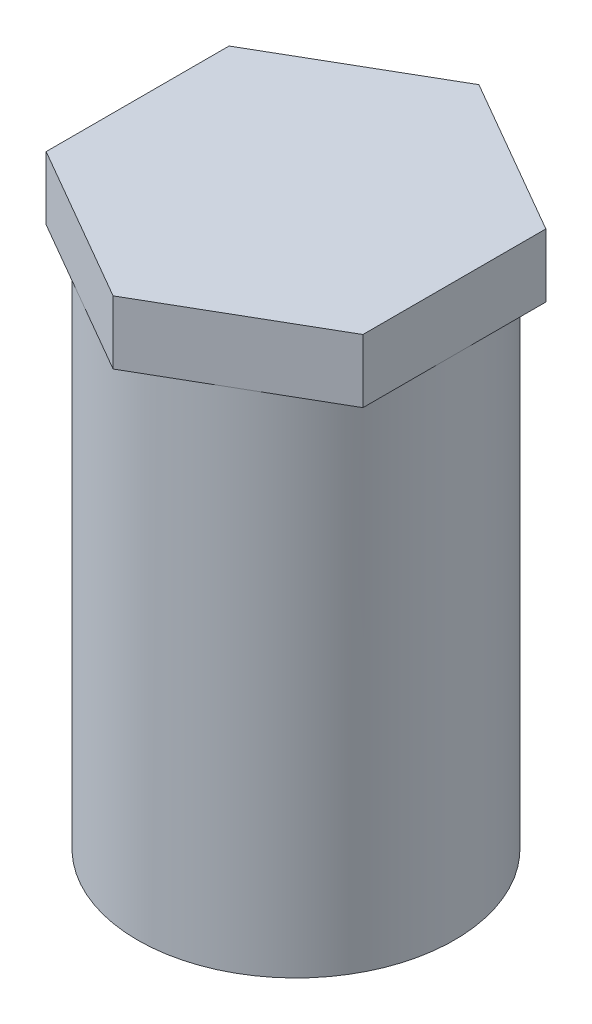
ISO-10303-21;
HEADER;
FILE_DESCRIPTION(('STEP AP214'),'2;1');
FILE_NAME('part.step','',(''),(''),'','','');
FILE_SCHEMA(('AUTOMOTIVE_DESIGN { 1 0 10303 214 1 1 1 1 }'));
ENDSEC;
DATA;
#1=APPLICATION_CONTEXT('core data for automotive mechanical design processes');
#2=APPLICATION_PROTOCOL_DEFINITION('international standard','automotive_design',2000,#1);
#3=PRODUCT_CONTEXT('',#1,'mechanical');
#4=PRODUCT('Part','Part','',(#3));
#5=PRODUCT_RELATED_PRODUCT_CATEGORY('part','',(#4));
#6=PRODUCT_DEFINITION_FORMATION('','',#4);
#7=PRODUCT_DEFINITION_CONTEXT('part definition',#1,'design');
#8=PRODUCT_DEFINITION('design','',#6,#7);
#9=PRODUCT_DEFINITION_SHAPE('','',#8);
#10=(LENGTH_UNIT() NAMED_UNIT(*) SI_UNIT(.MILLI.,.METRE.));
#11=(NAMED_UNIT(*) PLANE_ANGLE_UNIT() SI_UNIT($,.RADIAN.));
#12=(NAMED_UNIT(*) SI_UNIT($,.STERADIAN.) SOLID_ANGLE_UNIT());
#13=UNCERTAINTY_MEASURE_WITH_UNIT(LENGTH_MEASURE(1.E-05),#10,'distance_accuracy_value','');
#14=(GEOMETRIC_REPRESENTATION_CONTEXT(3) GLOBAL_UNCERTAINTY_ASSIGNED_CONTEXT((#13)) GLOBAL_UNIT_ASSIGNED_CONTEXT((#10,
#11,#12)) REPRESENTATION_CONTEXT('',''));
#15=CARTESIAN_POINT('',(0.,0.,0.));
#16=DIRECTION('',(0.,0.,1.));
#17=DIRECTION('',(1.,0.,0.));
#18=AXIS2_PLACEMENT_3D('',#15,#16,#17);
#19=CARTESIAN_POINT('',(0.,40.,0.));
#20=DIRECTION('',(0.,-1.,0.));
#21=DIRECTION('',(0.,0.,-1.));
#22=AXIS2_PLACEMENT_3D('',#19,#20,#21);
#23=CYLINDRICAL_SURFACE('',#22,12.5);
#24=CARTESIAN_POINT('',(0.,40.,0.));
#25=DIRECTION('',(0.,1.,0.));
#26=DIRECTION('',(0.,0.,1.));
#27=AXIS2_PLACEMENT_3D('',#24,#25,#26);
#28=CIRCLE('',#27,12.5);
#29=CARTESIAN_POINT('',(6.25,40.,10.8253175473055));
#30=VERTEX_POINT('',#29);
#31=CARTESIAN_POINT('',(12.5,40.,0.));
#32=VERTEX_POINT('',#31);
#33=EDGE_CURVE('E11',#30,#32,#28,.T.);
#34=ORIENTED_EDGE('',*,*,#33,.F.);
#35=CARTESIAN_POINT('',(-6.25000000000001,40.,10.8253175473055));
#36=VERTEX_POINT('',#35);
#37=EDGE_CURVE('E43',#36,#30,#28,.T.);
#38=ORIENTED_EDGE('',*,*,#37,.F.);
#39=CARTESIAN_POINT('',(-12.5,40.,0.));
#40=VERTEX_POINT('',#39);
#41=EDGE_CURVE('E53',#40,#36,#28,.T.);
#42=ORIENTED_EDGE('',*,*,#41,.F.);
#43=CARTESIAN_POINT('',(-6.25000000000001,40.,-10.8253175473055));
#44=VERTEX_POINT('',#43);
#45=EDGE_CURVE('E193',#44,#40,#28,.T.);
#46=ORIENTED_EDGE('',*,*,#45,.F.);
#47=CARTESIAN_POINT('',(6.25,40.,-10.8253175473055));
#48=VERTEX_POINT('',#47);
#49=EDGE_CURVE('E203',#48,#44,#28,.T.);
#50=ORIENTED_EDGE('',*,*,#49,.F.);
#51=EDGE_CURVE('E42',#32,#48,#28,.T.);
#52=ORIENTED_EDGE('',*,*,#51,.F.);
#53=EDGE_LOOP('',(#34,#38,#42,#46,#50,#52));
#54=FACE_BOUND('',#53,.T.);
#55=CARTESIAN_POINT('',(0.,0.,0.));
#56=DIRECTION('',(0.,1.,0.));
#57=DIRECTION('',(0.,0.,1.));
#58=AXIS2_PLACEMENT_3D('',#55,#56,#57);
#59=CIRCLE('',#58,12.5);
#60=CARTESIAN_POINT('',(0.,0.,12.5));
#61=VERTEX_POINT('',#60);
#62=EDGE_CURVE('E37',#61,#61,#59,.T.);
#63=ORIENTED_EDGE('',*,*,#62,.T.);
#64=EDGE_LOOP('',(#63));
#65=FACE_BOUND('',#64,.T.);
#66=ADVANCED_FACE('F34',(#54,#65),#23,.T.);
#67=CARTESIAN_POINT('',(0.,0.,0.));
#68=DIRECTION('',(0.,1.,0.));
#69=DIRECTION('',(0.,0.,1.));
#70=AXIS2_PLACEMENT_3D('',#67,#68,#69);
#71=PLANE('',#70);
#72=ORIENTED_EDGE('',*,*,#62,.F.);
#73=EDGE_LOOP('',(#72));
#74=FACE_BOUND('',#73,.T.);
#75=ADVANCED_FACE('F211',(#74),#71,.F.);
#76=CARTESIAN_POINT('',(0.,40.,0.));
#77=DIRECTION('',(0.,1.,0.));
#78=DIRECTION('',(0.,0.,1.));
#79=AXIS2_PLACEMENT_3D('',#76,#77,#78);
#80=PLANE('',#79);
#81=DIRECTION('',(0.866025403784438,0.,-0.5));
#82=VECTOR('',#81,1.);
#83=CARTESIAN_POINT('',(0.,40.,14.4337567297406));
#84=LINE('',#83,#82);
#85=CARTESIAN_POINT('',(12.5,40.,7.21687836487032));
#86=VERTEX_POINT('',#85);
#87=EDGE_CURVE('E162',#30,#86,#84,.T.);
#88=ORIENTED_EDGE('',*,*,#87,.F.);
#89=ORIENTED_EDGE('',*,*,#33,.T.);
#90=DIRECTION('',(0.,0.,-1.));
#91=VECTOR('',#90,1.);
#92=CARTESIAN_POINT('',(12.5,40.,7.21687836487032));
#93=LINE('',#92,#91);
#94=EDGE_CURVE('E156',#86,#32,#93,.T.);
#95=ORIENTED_EDGE('',*,*,#94,.F.);
#96=EDGE_LOOP('',(#88,#89,#95));
#97=FACE_BOUND('',#96,.T.);
#98=ADVANCED_FACE('F199',(#97),#80,.F.);
#99=CARTESIAN_POINT('',(12.5,40.,-7.21687836487033));
#100=VERTEX_POINT('',#99);
#101=EDGE_CURVE('E159',#32,#100,#93,.T.);
#102=ORIENTED_EDGE('',*,*,#101,.F.);
#103=ORIENTED_EDGE('',*,*,#51,.T.);
#104=DIRECTION('',(-0.866025403784439,0.,-0.5));
#105=VECTOR('',#104,1.);
#106=CARTESIAN_POINT('',(12.5,40.,-7.21687836487033));
#107=LINE('',#106,#105);
#108=EDGE_CURVE('E152',#100,#48,#107,.T.);
#109=ORIENTED_EDGE('',*,*,#108,.F.);
#110=EDGE_LOOP('',(#102,#103,#109));
#111=FACE_BOUND('',#110,.T.);
#112=ADVANCED_FACE('F202',(#111),#80,.F.);
#113=CARTESIAN_POINT('',(0.,40.,-14.4337567297407));
#114=VERTEX_POINT('',#113);
#115=EDGE_CURVE('E155',#48,#114,#107,.T.);
#116=ORIENTED_EDGE('',*,*,#115,.F.);
#117=ORIENTED_EDGE('',*,*,#49,.T.);
#118=DIRECTION('',(-0.866025403784439,0.,0.5));
#119=VECTOR('',#118,1.);
#120=CARTESIAN_POINT('',(0.,40.,-14.4337567297407));
#121=LINE('',#120,#119);
#122=EDGE_CURVE('E148',#114,#44,#121,.T.);
#123=ORIENTED_EDGE('',*,*,#122,.F.);
#124=EDGE_LOOP('',(#116,#117,#123));
#125=FACE_BOUND('',#124,.T.);
#126=ADVANCED_FACE('F206',(#125),#80,.F.);
#127=CARTESIAN_POINT('',(-12.5,40.,-7.21687836487032));
#128=VERTEX_POINT('',#127);
#129=EDGE_CURVE('E151',#44,#128,#121,.T.);
#130=ORIENTED_EDGE('',*,*,#129,.F.);
#131=ORIENTED_EDGE('',*,*,#45,.T.);
#132=DIRECTION('',(0.,0.,1.));
#133=VECTOR('',#132,1.);
#134=CARTESIAN_POINT('',(-12.5,40.,-7.21687836487032));
#135=LINE('',#134,#133);
#136=EDGE_CURVE('E123',#128,#40,#135,.T.);
#137=ORIENTED_EDGE('',*,*,#136,.F.);
#138=EDGE_LOOP('',(#130,#131,#137));
#139=FACE_BOUND('',#138,.T.);
#140=ADVANCED_FACE('F208',(#139),#80,.F.);
#141=CARTESIAN_POINT('',(-12.5,40.,7.21687836487032));
#142=VERTEX_POINT('',#141);
#143=EDGE_CURVE('E147',#40,#142,#135,.T.);
#144=ORIENTED_EDGE('',*,*,#143,.F.);
#145=ORIENTED_EDGE('',*,*,#41,.T.);
#146=DIRECTION('',(0.866025403784439,0.,0.5));
#147=VECTOR('',#146,1.);
#148=CARTESIAN_POINT('',(-12.5,40.,7.21687836487032));
#149=LINE('',#148,#147);
#150=EDGE_CURVE('E163',#142,#36,#149,.T.);
#151=ORIENTED_EDGE('',*,*,#150,.F.);
#152=EDGE_LOOP('',(#144,#145,#151));
#153=FACE_BOUND('',#152,.T.);
#154=ADVANCED_FACE('F192',(#153),#80,.F.);
#155=CARTESIAN_POINT('',(0.,40.,14.4337567297406));
#156=VERTEX_POINT('',#155);
#157=EDGE_CURVE('E128',#36,#156,#149,.T.);
#158=ORIENTED_EDGE('',*,*,#157,.F.);
#159=ORIENTED_EDGE('',*,*,#37,.T.);
#160=EDGE_CURVE('E160',#156,#30,#84,.T.);
#161=ORIENTED_EDGE('',*,*,#160,.F.);
#162=EDGE_LOOP('',(#158,#159,#161));
#163=FACE_BOUND('',#162,.T.);
#164=ADVANCED_FACE('F195',(#163),#80,.F.);
#165=CARTESIAN_POINT('',(-12.5,45.,7.21687836487032));
#166=DIRECTION('',(0.5,0.,-0.866025403784439));
#167=DIRECTION('',(-0.866025403784439,0.,-0.5));
#168=AXIS2_PLACEMENT_3D('',#165,#166,#167);
#169=PLANE('',#168);
#170=ORIENTED_EDGE('',*,*,#150,.T.);
#171=ORIENTED_EDGE('',*,*,#157,.T.);
#172=DIRECTION('',(0.,-1.,0.));
#173=VECTOR('',#172,1.);
#174=CARTESIAN_POINT('',(0.,45.,14.4337567297406));
#175=LINE('',#174,#173);
#176=CARTESIAN_POINT('',(0.,45.,14.4337567297406));
#177=VERTEX_POINT('',#176);
#178=EDGE_CURVE('E108',#177,#156,#175,.T.);
#179=ORIENTED_EDGE('',*,*,#178,.F.);
#180=DIRECTION('',(0.866025403784439,0.,0.5));
#181=VECTOR('',#180,1.);
#182=CARTESIAN_POINT('',(-12.5,45.,7.21687836487032));
#183=LINE('',#182,#181);
#184=CARTESIAN_POINT('',(-12.5,45.,7.21687836487032));
#185=VERTEX_POINT('',#184);
#186=EDGE_CURVE('E114',#185,#177,#183,.T.);
#187=ORIENTED_EDGE('',*,*,#186,.F.);
#188=DIRECTION('',(0.,-1.,0.));
#189=VECTOR('',#188,1.);
#190=CARTESIAN_POINT('',(-12.5,45.,7.21687836487032));
#191=LINE('',#190,#189);
#192=EDGE_CURVE('E143',#185,#142,#191,.T.);
#193=ORIENTED_EDGE('',*,*,#192,.T.);
#194=EDGE_LOOP('',(#170,#171,#179,#187,#193));
#195=FACE_BOUND('',#194,.T.);
#196=ADVANCED_FACE('F126',(#195),#169,.F.);
#197=CARTESIAN_POINT('',(0.,45.,14.4337567297406));
#198=DIRECTION('',(-0.5,0.,-0.866025403784439));
#199=DIRECTION('',(-0.866025403784439,0.,0.5));
#200=AXIS2_PLACEMENT_3D('',#197,#198,#199);
#201=PLANE('',#200);
#202=ORIENTED_EDGE('',*,*,#160,.T.);
#203=ORIENTED_EDGE('',*,*,#87,.T.);
#204=DIRECTION('',(0.,-1.,0.));
#205=VECTOR('',#204,1.);
#206=CARTESIAN_POINT('',(12.5,45.,7.21687836487032));
#207=LINE('',#206,#205);
#208=CARTESIAN_POINT('',(12.5,45.,7.21687836487032));
#209=VERTEX_POINT('',#208);
#210=EDGE_CURVE('E110',#209,#86,#207,.T.);
#211=ORIENTED_EDGE('',*,*,#210,.F.);
#212=DIRECTION('',(0.866025403784438,0.,-0.5));
#213=VECTOR('',#212,1.);
#214=CARTESIAN_POINT('',(0.,45.,14.4337567297406));
#215=LINE('',#214,#213);
#216=EDGE_CURVE('E103',#177,#209,#215,.T.);
#217=ORIENTED_EDGE('',*,*,#216,.F.);
#218=ORIENTED_EDGE('',*,*,#178,.T.);
#219=EDGE_LOOP('',(#202,#203,#211,#217,#218));
#220=FACE_BOUND('',#219,.T.);
#221=ADVANCED_FACE('F106',(#220),#201,.F.);
#222=CARTESIAN_POINT('',(12.5,45.,7.21687836487032));
#223=DIRECTION('',(-1.,0.,0.));
#224=DIRECTION('',(0.,0.,1.));
#225=AXIS2_PLACEMENT_3D('',#222,#223,#224);
#226=PLANE('',#225);
#227=ORIENTED_EDGE('',*,*,#94,.T.);
#228=ORIENTED_EDGE('',*,*,#101,.T.);
#229=DIRECTION('',(0.,-1.,0.));
#230=VECTOR('',#229,1.);
#231=CARTESIAN_POINT('',(12.5,45.,-7.21687836487033));
#232=LINE('',#231,#230);
#233=CARTESIAN_POINT('',(12.5,45.,-7.21687836487033));
#234=VERTEX_POINT('',#233);
#235=EDGE_CURVE('E132',#234,#100,#232,.T.);
#236=ORIENTED_EDGE('',*,*,#235,.F.);
#237=DIRECTION('',(0.,0.,-1.));
#238=VECTOR('',#237,1.);
#239=CARTESIAN_POINT('',(12.5,45.,7.21687836487032));
#240=LINE('',#239,#238);
#241=EDGE_CURVE('E113',#209,#234,#240,.T.);
#242=ORIENTED_EDGE('',*,*,#241,.F.);
#243=ORIENTED_EDGE('',*,*,#210,.T.);
#244=EDGE_LOOP('',(#227,#228,#236,#242,#243));
#245=FACE_BOUND('',#244,.T.);
#246=ADVANCED_FACE('F174',(#245),#226,.F.);
#247=CARTESIAN_POINT('',(12.5,45.,-7.21687836487033));
#248=DIRECTION('',(-0.5,0.,0.866025403784439));
#249=DIRECTION('',(0.866025403784439,0.,0.5));
#250=AXIS2_PLACEMENT_3D('',#247,#248,#249);
#251=PLANE('',#250);
#252=ORIENTED_EDGE('',*,*,#108,.T.);
#253=ORIENTED_EDGE('',*,*,#115,.T.);
#254=DIRECTION('',(0.,-1.,0.));
#255=VECTOR('',#254,1.);
#256=CARTESIAN_POINT('',(0.,45.,-14.4337567297407));
#257=LINE('',#256,#255);
#258=CARTESIAN_POINT('',(0.,45.,-14.4337567297407));
#259=VERTEX_POINT('',#258);
#260=EDGE_CURVE('E137',#259,#114,#257,.T.);
#261=ORIENTED_EDGE('',*,*,#260,.F.);
#262=DIRECTION('',(-0.866025403784439,0.,-0.5));
#263=VECTOR('',#262,1.);
#264=CARTESIAN_POINT('',(12.5,45.,-7.21687836487033));
#265=LINE('',#264,#263);
#266=EDGE_CURVE('E168',#234,#259,#265,.T.);
#267=ORIENTED_EDGE('',*,*,#266,.F.);
#268=ORIENTED_EDGE('',*,*,#235,.T.);
#269=EDGE_LOOP('',(#252,#253,#261,#267,#268));
#270=FACE_BOUND('',#269,.T.);
#271=ADVANCED_FACE('F178',(#270),#251,.F.);
#272=CARTESIAN_POINT('',(0.,45.,-14.4337567297407));
#273=DIRECTION('',(0.5,0.,0.866025403784439));
#274=DIRECTION('',(0.866025403784439,0.,-0.5));
#275=AXIS2_PLACEMENT_3D('',#272,#273,#274);
#276=PLANE('',#275);
#277=ORIENTED_EDGE('',*,*,#122,.T.);
#278=ORIENTED_EDGE('',*,*,#129,.T.);
#279=DIRECTION('',(0.,-1.,0.));
#280=VECTOR('',#279,1.);
#281=CARTESIAN_POINT('',(-12.5,45.,-7.21687836487032));
#282=LINE('',#281,#280);
#283=CARTESIAN_POINT('',(-12.5,45.,-7.21687836487032));
#284=VERTEX_POINT('',#283);
#285=EDGE_CURVE('E140',#284,#128,#282,.T.);
#286=ORIENTED_EDGE('',*,*,#285,.F.);
#287=DIRECTION('',(-0.866025403784439,0.,0.5));
#288=VECTOR('',#287,1.);
#289=CARTESIAN_POINT('',(0.,45.,-14.4337567297407));
#290=LINE('',#289,#288);
#291=EDGE_CURVE('E166',#259,#284,#290,.T.);
#292=ORIENTED_EDGE('',*,*,#291,.F.);
#293=ORIENTED_EDGE('',*,*,#260,.T.);
#294=EDGE_LOOP('',(#277,#278,#286,#292,#293));
#295=FACE_BOUND('',#294,.T.);
#296=ADVANCED_FACE('F184',(#295),#276,.F.);
#297=CARTESIAN_POINT('',(-12.5,45.,-7.21687836487032));
#298=DIRECTION('',(1.,0.,0.));
#299=DIRECTION('',(0.,0.,-1.));
#300=AXIS2_PLACEMENT_3D('',#297,#298,#299);
#301=PLANE('',#300);
#302=ORIENTED_EDGE('',*,*,#136,.T.);
#303=ORIENTED_EDGE('',*,*,#143,.T.);
#304=ORIENTED_EDGE('',*,*,#192,.F.);
#305=DIRECTION('',(0.,0.,1.));
#306=VECTOR('',#305,1.);
#307=CARTESIAN_POINT('',(-12.5,45.,-7.21687836487032));
#308=LINE('',#307,#306);
#309=EDGE_CURVE('E119',#284,#185,#308,.T.);
#310=ORIENTED_EDGE('',*,*,#309,.F.);
#311=ORIENTED_EDGE('',*,*,#285,.T.);
#312=EDGE_LOOP('',(#302,#303,#304,#310,#311));
#313=FACE_BOUND('',#312,.T.);
#314=ADVANCED_FACE('F188',(#313),#301,.F.);
#315=CARTESIAN_POINT('',(0.,45.,0.));
#316=DIRECTION('',(0.,1.,0.));
#317=DIRECTION('',(0.,0.,1.));
#318=AXIS2_PLACEMENT_3D('',#315,#316,#317);
#319=PLANE('',#318);
#320=ORIENTED_EDGE('',*,*,#186,.T.);
#321=ORIENTED_EDGE('',*,*,#216,.T.);
#322=ORIENTED_EDGE('',*,*,#241,.T.);
#323=ORIENTED_EDGE('',*,*,#266,.T.);
#324=ORIENTED_EDGE('',*,*,#291,.T.);
#325=ORIENTED_EDGE('',*,*,#309,.T.);
#326=EDGE_LOOP('',(#320,#321,#322,#323,#324,#325));
#327=FACE_BOUND('',#326,.T.);
#328=ADVANCED_FACE('F117',(#327),#319,.T.);
#329=CLOSED_SHELL('',(#66,#75,#98,#112,#126,#140,#154,#164,#196,#221,#246,#271,#296,#314,#328));
#330=MANIFOLD_SOLID_BREP('B2',#329);
#331=ADVANCED_BREP_SHAPE_REPRESENTATION('',(#18,#330),#14);
#332=SHAPE_DEFINITION_REPRESENTATION(#9,#331);
ENDSEC;
END-ISO-10303-21;
